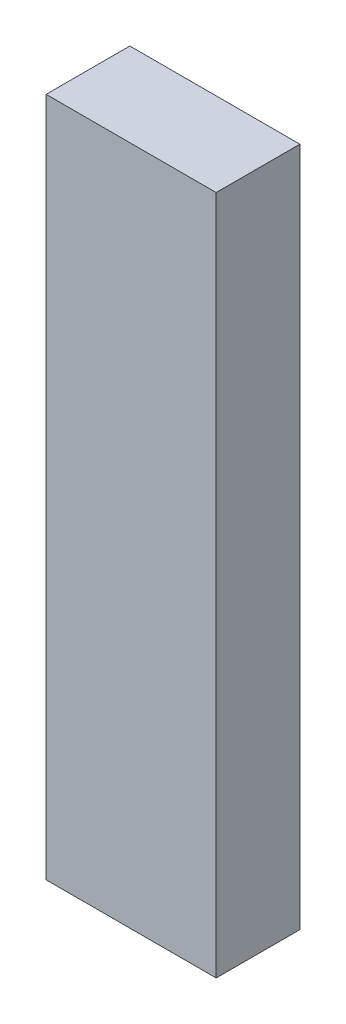
ISO-10303-21;
HEADER;
FILE_DESCRIPTION(('STEP AP214'),'2;1');
FILE_NAME('part.step','',(''),(''),'','','');
FILE_SCHEMA(('AUTOMOTIVE_DESIGN { 1 0 10303 214 1 1 1 1 }'));
ENDSEC;
DATA;
#1=APPLICATION_CONTEXT('core data for automotive mechanical design processes');
#2=APPLICATION_PROTOCOL_DEFINITION('international standard','automotive_design',2000,#1);
#3=PRODUCT_CONTEXT('',#1,'mechanical');
#4=PRODUCT('Part','Part','',(#3));
#5=PRODUCT_RELATED_PRODUCT_CATEGORY('part','',(#4));
#6=PRODUCT_DEFINITION_FORMATION('','',#4);
#7=PRODUCT_DEFINITION_CONTEXT('part definition',#1,'design');
#8=PRODUCT_DEFINITION('design','',#6,#7);
#9=PRODUCT_DEFINITION_SHAPE('','',#8);
#10=(LENGTH_UNIT() NAMED_UNIT(*) SI_UNIT(.MILLI.,.METRE.));
#11=(NAMED_UNIT(*) PLANE_ANGLE_UNIT() SI_UNIT($,.RADIAN.));
#12=(NAMED_UNIT(*) SI_UNIT($,.STERADIAN.) SOLID_ANGLE_UNIT());
#13=UNCERTAINTY_MEASURE_WITH_UNIT(LENGTH_MEASURE(1.E-05),#10,'distance_accuracy_value','');
#14=(GEOMETRIC_REPRESENTATION_CONTEXT(3) GLOBAL_UNCERTAINTY_ASSIGNED_CONTEXT((#13)) GLOBAL_UNIT_ASSIGNED_CONTEXT((#10,
#11,#12)) REPRESENTATION_CONTEXT('',''));
#15=CARTESIAN_POINT('',(0.,0.,0.));
#16=DIRECTION('',(0.,0.,1.));
#17=DIRECTION('',(1.,0.,0.));
#18=AXIS2_PLACEMENT_3D('',#15,#16,#17);
#19=CARTESIAN_POINT('',(-0.3250057,0.68579492,0.31999936));
#20=DIRECTION('',(0.,0.,-1.));
#21=DIRECTION('',(-1.,0.,0.));
#22=AXIS2_PLACEMENT_3D('',#19,#20,#21);
#23=PLANE('',#22);
#24=DIRECTION('',(0.,1.,0.));
#25=VECTOR('',#24,1.);
#26=CARTESIAN_POINT('',(0.32499554,-1.91420496,0.31999936));
#27=LINE('',#26,#25);
#28=CARTESIAN_POINT('',(0.32499554,-1.91420496,0.31999936));
#29=VERTEX_POINT('',#28);
#30=CARTESIAN_POINT('',(0.32499554,0.68579492,0.31999936));
#31=VERTEX_POINT('',#30);
#32=EDGE_CURVE('E79',#29,#31,#27,.T.);
#33=ORIENTED_EDGE('',*,*,#32,.T.);
#34=DIRECTION('',(1.,0.,0.));
#35=VECTOR('',#34,1.);
#36=CARTESIAN_POINT('',(0.32499554,0.68579492,0.31999936));
#37=LINE('',#36,#35);
#38=CARTESIAN_POINT('',(-0.3250057,0.68579492,0.31999936));
#39=VERTEX_POINT('',#38);
#40=EDGE_CURVE('E54',#31,#39,#37,.F.);
#41=ORIENTED_EDGE('',*,*,#40,.T.);
#42=DIRECTION('',(0.,1.,0.));
#43=VECTOR('',#42,1.);
#44=CARTESIAN_POINT('',(-0.3250057,0.68579492,0.31999936));
#45=LINE('',#44,#43);
#46=CARTESIAN_POINT('',(-0.3250057,-1.91420496,0.31999936));
#47=VERTEX_POINT('',#46);
#48=EDGE_CURVE('E56',#39,#47,#45,.F.);
#49=ORIENTED_EDGE('',*,*,#48,.T.);
#50=DIRECTION('',(1.,0.,0.));
#51=VECTOR('',#50,1.);
#52=CARTESIAN_POINT('',(-0.3250057,-1.91420496,0.31999936));
#53=LINE('',#52,#51);
#54=EDGE_CURVE('E19',#47,#29,#53,.T.);
#55=ORIENTED_EDGE('',*,*,#54,.T.);
#56=EDGE_LOOP('',(#33,#41,#49,#55));
#57=FACE_BOUND('',#56,.T.);
#58=ADVANCED_FACE('F16',(#57),#23,.F.);
#59=CARTESIAN_POINT('',(-0.3250057,-1.91420496,0.));
#60=DIRECTION('',(0.,1.,0.));
#61=DIRECTION('',(0.,0.,1.));
#62=AXIS2_PLACEMENT_3D('',#59,#60,#61);
#63=PLANE('',#62);
#64=ORIENTED_EDGE('',*,*,#54,.F.);
#65=DIRECTION('',(0.,0.,-1.));
#66=VECTOR('',#65,1.);
#67=CARTESIAN_POINT('',(-0.3250057,-1.91420496,0.));
#68=LINE('',#67,#66);
#69=CARTESIAN_POINT('',(-0.3250057,-1.91420496,0.));
#70=VERTEX_POINT('',#69);
#71=EDGE_CURVE('E62',#47,#70,#68,.T.);
#72=ORIENTED_EDGE('',*,*,#71,.T.);
#73=DIRECTION('',(-1.,0.,0.));
#74=VECTOR('',#73,1.);
#75=CARTESIAN_POINT('',(-0.3250057,-1.91420496,0.));
#76=LINE('',#75,#74);
#77=CARTESIAN_POINT('',(0.32499554,-1.91420496,0.));
#78=VERTEX_POINT('',#77);
#79=EDGE_CURVE('E82',#78,#70,#76,.T.);
#80=ORIENTED_EDGE('',*,*,#79,.F.);
#81=DIRECTION('',(0.,0.,1.));
#82=VECTOR('',#81,1.);
#83=CARTESIAN_POINT('',(0.32499554,-1.91420496,0.));
#84=LINE('',#83,#82);
#85=EDGE_CURVE('E67',#78,#29,#84,.T.);
#86=ORIENTED_EDGE('',*,*,#85,.T.);
#87=EDGE_LOOP('',(#64,#72,#80,#86));
#88=FACE_BOUND('',#87,.T.);
#89=ADVANCED_FACE('F64',(#88),#63,.F.);
#90=CARTESIAN_POINT('',(-0.3250057,0.68579492,0.));
#91=DIRECTION('',(1.,0.,0.));
#92=DIRECTION('',(0.,0.,-1.));
#93=AXIS2_PLACEMENT_3D('',#90,#91,#92);
#94=PLANE('',#93);
#95=ORIENTED_EDGE('',*,*,#48,.F.);
#96=DIRECTION('',(0.,0.,-1.));
#97=VECTOR('',#96,1.);
#98=CARTESIAN_POINT('',(-0.3250057,0.68579492,0.));
#99=LINE('',#98,#97);
#100=CARTESIAN_POINT('',(-0.3250057,0.68579492,0.));
#101=VERTEX_POINT('',#100);
#102=EDGE_CURVE('E74',#39,#101,#99,.T.);
#103=ORIENTED_EDGE('',*,*,#102,.T.);
#104=DIRECTION('',(0.,1.,0.));
#105=VECTOR('',#104,1.);
#106=CARTESIAN_POINT('',(-0.3250057,0.68579492,0.));
#107=LINE('',#106,#105);
#108=EDGE_CURVE('E71',#70,#101,#107,.T.);
#109=ORIENTED_EDGE('',*,*,#108,.F.);
#110=ORIENTED_EDGE('',*,*,#71,.F.);
#111=EDGE_LOOP('',(#95,#103,#109,#110));
#112=FACE_BOUND('',#111,.T.);
#113=ADVANCED_FACE('F69',(#112),#94,.F.);
#114=CARTESIAN_POINT('',(0.32499554,0.68579492,0.));
#115=DIRECTION('',(0.,-1.,0.));
#116=DIRECTION('',(0.,0.,-1.));
#117=AXIS2_PLACEMENT_3D('',#114,#115,#116);
#118=PLANE('',#117);
#119=ORIENTED_EDGE('',*,*,#40,.F.);
#120=DIRECTION('',(0.,0.,1.));
#121=VECTOR('',#120,1.);
#122=CARTESIAN_POINT('',(0.32499554,0.68579492,0.));
#123=LINE('',#122,#121);
#124=CARTESIAN_POINT('',(0.32499554,0.68579492,0.));
#125=VERTEX_POINT('',#124);
#126=EDGE_CURVE('E34',#31,#125,#123,.F.);
#127=ORIENTED_EDGE('',*,*,#126,.T.);
#128=DIRECTION('',(-1.,0.,0.));
#129=VECTOR('',#128,1.);
#130=CARTESIAN_POINT('',(-0.3250057,0.68579492,0.));
#131=LINE('',#130,#129);
#132=EDGE_CURVE('E25',#101,#125,#131,.F.);
#133=ORIENTED_EDGE('',*,*,#132,.F.);
#134=ORIENTED_EDGE('',*,*,#102,.F.);
#135=EDGE_LOOP('',(#119,#127,#133,#134));
#136=FACE_BOUND('',#135,.T.);
#137=ADVANCED_FACE('F88',(#136),#118,.F.);
#138=CARTESIAN_POINT('',(0.32499554,-1.91420496,0.));
#139=DIRECTION('',(-1.,0.,0.));
#140=DIRECTION('',(0.,0.,1.));
#141=AXIS2_PLACEMENT_3D('',#138,#139,#140);
#142=PLANE('',#141);
#143=ORIENTED_EDGE('',*,*,#32,.F.);
#144=ORIENTED_EDGE('',*,*,#85,.F.);
#145=DIRECTION('',(0.,1.,0.));
#146=VECTOR('',#145,1.);
#147=CARTESIAN_POINT('',(0.32499554,0.68579492,0.));
#148=LINE('',#147,#146);
#149=EDGE_CURVE('E11',#125,#78,#148,.F.);
#150=ORIENTED_EDGE('',*,*,#149,.F.);
#151=ORIENTED_EDGE('',*,*,#126,.F.);
#152=EDGE_LOOP('',(#143,#144,#150,#151));
#153=FACE_BOUND('',#152,.T.);
#154=ADVANCED_FACE('F90',(#153),#142,.F.);
#155=CARTESIAN_POINT('',(-0.3250057,0.68579492,0.));
#156=DIRECTION('',(0.,0.,-1.));
#157=DIRECTION('',(-1.,0.,0.));
#158=AXIS2_PLACEMENT_3D('',#155,#156,#157);
#159=PLANE('',#158);
#160=ORIENTED_EDGE('',*,*,#132,.T.);
#161=ORIENTED_EDGE('',*,*,#149,.T.);
#162=ORIENTED_EDGE('',*,*,#79,.T.);
#163=ORIENTED_EDGE('',*,*,#108,.T.);
#164=EDGE_LOOP('',(#160,#161,#162,#163));
#165=FACE_BOUND('',#164,.T.);
#166=ADVANCED_FACE('F87',(#165),#159,.T.);
#167=CLOSED_SHELL('',(#58,#89,#113,#137,#154,#166));
#168=MANIFOLD_SOLID_BREP('B1',#167);
#169=ADVANCED_BREP_SHAPE_REPRESENTATION('',(#18,#168),#14);
#170=SHAPE_DEFINITION_REPRESENTATION(#9,#169);
ENDSEC;
END-ISO-10303-21;
